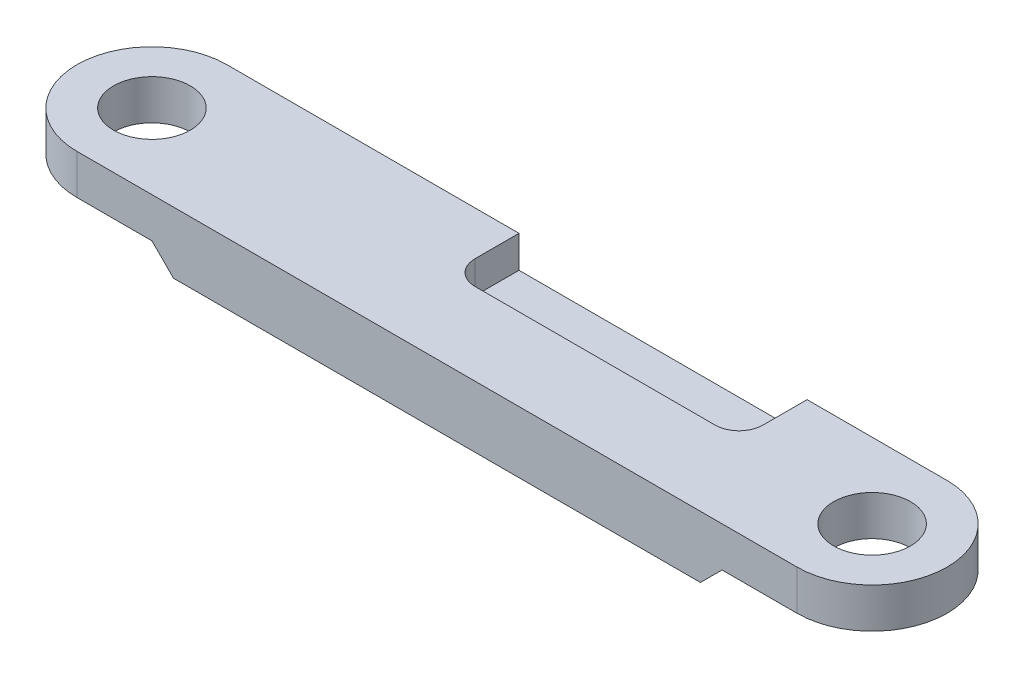
ISO-10303-21;
HEADER;
FILE_DESCRIPTION(('STEP AP214'),'2;1');
FILE_NAME('part.step','',(''),(''),'','','');
FILE_SCHEMA(('AUTOMOTIVE_DESIGN { 1 0 10303 214 1 1 1 1 }'));
ENDSEC;
DATA;
#1=APPLICATION_CONTEXT('core data for automotive mechanical design processes');
#2=APPLICATION_PROTOCOL_DEFINITION('international standard','automotive_design',2000,#1);
#3=PRODUCT_CONTEXT('',#1,'mechanical');
#4=PRODUCT('Part','Part','',(#3));
#5=PRODUCT_RELATED_PRODUCT_CATEGORY('part','',(#4));
#6=PRODUCT_DEFINITION_FORMATION('','',#4);
#7=PRODUCT_DEFINITION_CONTEXT('part definition',#1,'design');
#8=PRODUCT_DEFINITION('design','',#6,#7);
#9=PRODUCT_DEFINITION_SHAPE('','',#8);
#10=(LENGTH_UNIT() NAMED_UNIT(*) SI_UNIT(.MILLI.,.METRE.));
#11=(NAMED_UNIT(*) PLANE_ANGLE_UNIT() SI_UNIT($,.RADIAN.));
#12=(NAMED_UNIT(*) SI_UNIT($,.STERADIAN.) SOLID_ANGLE_UNIT());
#13=UNCERTAINTY_MEASURE_WITH_UNIT(LENGTH_MEASURE(1.E-05),#10,'distance_accuracy_value','');
#14=(GEOMETRIC_REPRESENTATION_CONTEXT(3) GLOBAL_UNCERTAINTY_ASSIGNED_CONTEXT((#13)) GLOBAL_UNIT_ASSIGNED_CONTEXT((#10,
#11,#12)) REPRESENTATION_CONTEXT('',''));
#15=CARTESIAN_POINT('',(0.,0.,0.));
#16=DIRECTION('',(0.,0.,1.));
#17=DIRECTION('',(1.,0.,0.));
#18=AXIS2_PLACEMENT_3D('',#15,#16,#17);
#19=CARTESIAN_POINT('',(-11.43,1.9558,0.));
#20=DIRECTION('',(0.,1.,0.));
#21=DIRECTION('',(0.,0.,1.));
#22=AXIS2_PLACEMENT_3D('',#19,#20,#21);
#23=PLANE('',#22);
#24=DIRECTION('',(0.,0.,-1.));
#25=VECTOR('',#24,1.);
#26=CARTESIAN_POINT('',(6.985,1.9558,-0.222250000000002));
#27=LINE('',#26,#25);
#28=CARTESIAN_POINT('',(6.985,1.9558,-0.984250000000003));
#29=VERTEX_POINT('',#28);
#30=CARTESIAN_POINT('',(6.985,1.9558,-2.38125));
#31=VERTEX_POINT('',#30);
#32=EDGE_CURVE('E239',#29,#31,#27,.T.);
#33=ORIENTED_EDGE('',*,*,#32,.F.);
#34=CARTESIAN_POINT('',(6.223,1.9558,-0.984250000000003));
#35=DIRECTION('',(0.,1.,0.));
#36=DIRECTION('',(0.,0.,1.));
#37=AXIS2_PLACEMENT_3D('',#34,#35,#36);
#38=CIRCLE('',#37,0.762);
#39=CARTESIAN_POINT('',(6.223,1.9558,-0.222250000000002));
#40=VERTEX_POINT('',#39);
#41=EDGE_CURVE('E11',#29,#40,#38,.F.);
#42=ORIENTED_EDGE('',*,*,#41,.T.);
#43=DIRECTION('',(1.,0.,0.));
#44=VECTOR('',#43,1.);
#45=CARTESIAN_POINT('',(6.985,1.9558,-0.222250000000002));
#46=LINE('',#45,#44);
#47=CARTESIAN_POINT('',(-1.397,1.9558,-0.222250000000001));
#48=VERTEX_POINT('',#47);
#49=EDGE_CURVE('E227',#48,#40,#46,.T.);
#50=ORIENTED_EDGE('',*,*,#49,.F.);
#51=CARTESIAN_POINT('',(-1.397,1.9558,-0.984250000000001));
#52=DIRECTION('',(0.,1.,0.));
#53=DIRECTION('',(0.,0.,1.));
#54=AXIS2_PLACEMENT_3D('',#51,#52,#53);
#55=CIRCLE('',#54,0.762);
#56=CARTESIAN_POINT('',(-2.159,1.9558,-0.984250000000001));
#57=VERTEX_POINT('',#56);
#58=EDGE_CURVE('E45',#48,#57,#55,.F.);
#59=ORIENTED_EDGE('',*,*,#58,.T.);
#60=DIRECTION('',(0.,0.,-1.));
#61=VECTOR('',#60,1.);
#62=CARTESIAN_POINT('',(-2.159,1.9558,-0.222250000000001));
#63=LINE('',#62,#61);
#64=CARTESIAN_POINT('',(-2.159,1.9558,-2.38125));
#65=VERTEX_POINT('',#64);
#66=EDGE_CURVE('E241',#57,#65,#63,.T.);
#67=ORIENTED_EDGE('',*,*,#66,.T.);
#68=DIRECTION('',(-1.,0.,0.));
#69=VECTOR('',#68,1.);
#70=CARTESIAN_POINT('',(-11.43,1.9558,-2.38125));
#71=LINE('',#70,#69);
#72=CARTESIAN_POINT('',(-11.43,1.9558,-2.38125));
#73=VERTEX_POINT('',#72);
#74=EDGE_CURVE('E252',#65,#73,#71,.T.);
#75=ORIENTED_EDGE('',*,*,#74,.T.);
#76=CARTESIAN_POINT('',(-11.43,1.9558,0.));
#77=DIRECTION('',(0.,1.,0.));
#78=DIRECTION('',(0.,0.,1.));
#79=AXIS2_PLACEMENT_3D('',#76,#77,#78);
#80=CIRCLE('',#79,2.38125);
#81=CARTESIAN_POINT('',(-11.43,1.9558,2.38125));
#82=VERTEX_POINT('',#81);
#83=EDGE_CURVE('E162',#73,#82,#80,.T.);
#84=ORIENTED_EDGE('',*,*,#83,.T.);
#85=DIRECTION('',(1.,0.,0.));
#86=VECTOR('',#85,1.);
#87=CARTESIAN_POINT('',(-11.43,1.9558,2.38125));
#88=LINE('',#87,#86);
#89=CARTESIAN_POINT('',(11.43,1.9558,2.38125));
#90=VERTEX_POINT('',#89);
#91=EDGE_CURVE('E250',#82,#90,#88,.T.);
#92=ORIENTED_EDGE('',*,*,#91,.T.);
#93=CARTESIAN_POINT('',(11.43,1.9558,0.));
#94=DIRECTION('',(0.,1.,0.));
#95=DIRECTION('',(0.,0.,-1.));
#96=AXIS2_PLACEMENT_3D('',#93,#94,#95);
#97=CIRCLE('',#96,2.38125);
#98=CARTESIAN_POINT('',(11.43,1.9558,-2.38125));
#99=VERTEX_POINT('',#98);
#100=EDGE_CURVE('E251',#90,#99,#97,.T.);
#101=ORIENTED_EDGE('',*,*,#100,.T.);
#102=EDGE_CURVE('E168',#99,#31,#71,.T.);
#103=ORIENTED_EDGE('',*,*,#102,.T.);
#104=EDGE_LOOP('',(#33,#42,#50,#59,#67,#75,#84,#92,#101,#103));
#105=FACE_BOUND('',#104,.T.);
#106=CARTESIAN_POINT('',(-11.43,1.9558,0.));
#107=DIRECTION('',(0.,1.,0.));
#108=DIRECTION('',(0.,0.,1.));
#109=AXIS2_PLACEMENT_3D('',#106,#107,#108);
#110=CIRCLE('',#109,1.2192);
#111=CARTESIAN_POINT('',(-11.43,1.9558,1.2192));
#112=VERTEX_POINT('',#111);
#113=EDGE_CURVE('E160',#112,#112,#110,.T.);
#114=ORIENTED_EDGE('',*,*,#113,.F.);
#115=EDGE_LOOP('',(#114));
#116=FACE_BOUND('',#115,.T.);
#117=CARTESIAN_POINT('',(11.43,1.9558,0.));
#118=DIRECTION('',(0.,1.,0.));
#119=DIRECTION('',(0.,0.,-1.));
#120=AXIS2_PLACEMENT_3D('',#117,#118,#119);
#121=CIRCLE('',#120,1.2192);
#122=CARTESIAN_POINT('',(11.43,1.9558,-1.2192));
#123=VERTEX_POINT('',#122);
#124=EDGE_CURVE('E165',#123,#123,#121,.T.);
#125=ORIENTED_EDGE('',*,*,#124,.F.);
#126=EDGE_LOOP('',(#125));
#127=FACE_BOUND('',#126,.T.);
#128=ADVANCED_FACE('F36',(#105,#116,#127),#23,.T.);
#129=CARTESIAN_POINT('',(-11.43,0.,0.));
#130=DIRECTION('',(0.,1.,0.));
#131=DIRECTION('',(0.,0.,1.));
#132=AXIS2_PLACEMENT_3D('',#129,#130,#131);
#133=PLANE('',#132);
#134=DIRECTION('',(-1.,0.,0.));
#135=VECTOR('',#134,1.);
#136=CARTESIAN_POINT('',(-11.43,0.,-2.38125));
#137=LINE('',#136,#135);
#138=CARTESIAN_POINT('',(8.36294999999999,0.,-2.38125));
#139=VERTEX_POINT('',#138);
#140=CARTESIAN_POINT('',(-8.36294999999999,0.,-2.38125));
#141=VERTEX_POINT('',#140);
#142=EDGE_CURVE('E154',#139,#141,#137,.T.);
#143=ORIENTED_EDGE('',*,*,#142,.F.);
#144=DIRECTION('',(0.,0.,-1.));
#145=VECTOR('',#144,1.);
#146=CARTESIAN_POINT('',(8.36294999999999,0.,2.38125));
#147=LINE('',#146,#145);
#148=CARTESIAN_POINT('',(8.36294999999999,0.,2.38125));
#149=VERTEX_POINT('',#148);
#150=EDGE_CURVE('E61',#149,#139,#147,.T.);
#151=ORIENTED_EDGE('',*,*,#150,.F.);
#152=DIRECTION('',(1.,0.,0.));
#153=VECTOR('',#152,1.);
#154=CARTESIAN_POINT('',(-11.43,0.,2.38125));
#155=LINE('',#154,#153);
#156=CARTESIAN_POINT('',(-8.36294999999999,0.,2.38125000000001));
#157=VERTEX_POINT('',#156);
#158=EDGE_CURVE('E152',#157,#149,#155,.T.);
#159=ORIENTED_EDGE('',*,*,#158,.F.);
#160=DIRECTION('',(0.,0.,-1.));
#161=VECTOR('',#160,1.);
#162=CARTESIAN_POINT('',(-8.36294999999999,0.,2.38125000000001));
#163=LINE('',#162,#161);
#164=EDGE_CURVE('E216',#157,#141,#163,.T.);
#165=ORIENTED_EDGE('',*,*,#164,.T.);
#166=EDGE_LOOP('',(#143,#151,#159,#165));
#167=FACE_BOUND('',#166,.T.);
#168=ADVANCED_FACE('F150',(#167),#133,.F.);
#169=CARTESIAN_POINT('',(-11.43,1.9558,0.));
#170=DIRECTION('',(0.,-1.,0.));
#171=DIRECTION('',(0.,0.,-1.));
#172=AXIS2_PLACEMENT_3D('',#169,#170,#171);
#173=CYLINDRICAL_SURFACE('',#172,2.38125);
#174=DIRECTION('',(0.,-1.,0.));
#175=VECTOR('',#174,1.);
#176=CARTESIAN_POINT('',(-11.43,1.9558,-2.38125));
#177=LINE('',#176,#175);
#178=CARTESIAN_POINT('',(-11.43,0.685800000000001,-2.38125));
#179=VERTEX_POINT('',#178);
#180=EDGE_CURVE('E171',#73,#179,#177,.T.);
#181=ORIENTED_EDGE('',*,*,#180,.T.);
#182=CARTESIAN_POINT('',(-11.43,0.685800000000001,0.));
#183=DIRECTION('',(0.,1.,0.));
#184=DIRECTION('',(-1.,0.,0.));
#185=AXIS2_PLACEMENT_3D('',#182,#183,#184);
#186=CIRCLE('',#185,2.38125);
#187=CARTESIAN_POINT('',(-11.43,0.685800000000001,2.38125000000001));
#188=VERTEX_POINT('',#187);
#189=EDGE_CURVE('E220',#179,#188,#186,.T.);
#190=ORIENTED_EDGE('',*,*,#189,.T.);
#191=DIRECTION('',(0.,-1.,0.));
#192=VECTOR('',#191,1.);
#193=CARTESIAN_POINT('',(-11.43,1.9558,2.38125));
#194=LINE('',#193,#192);
#195=EDGE_CURVE('E180',#82,#188,#194,.T.);
#196=ORIENTED_EDGE('',*,*,#195,.F.);
#197=ORIENTED_EDGE('',*,*,#83,.F.);
#198=EDGE_LOOP('',(#181,#190,#196,#197));
#199=FACE_BOUND('',#198,.T.);
#200=ADVANCED_FACE('F293',(#199),#173,.T.);
#201=CARTESIAN_POINT('',(-11.43,1.9558,2.38125));
#202=DIRECTION('',(0.,0.,-1.));
#203=DIRECTION('',(-1.,0.,0.));
#204=AXIS2_PLACEMENT_3D('',#201,#202,#203);
#205=PLANE('',#204);
#206=DIRECTION('',(0.707106781186552,0.707106781186544,0.));
#207=VECTOR('',#206,1.);
#208=CARTESIAN_POINT('',(8.36294999999999,0.,2.38125));
#209=LINE('',#208,#207);
#210=CARTESIAN_POINT('',(9.04875,0.6858,2.38125));
#211=VERTEX_POINT('',#210);
#212=EDGE_CURVE('E137',#149,#211,#209,.T.);
#213=ORIENTED_EDGE('',*,*,#212,.T.);
#214=DIRECTION('',(1.,0.,0.));
#215=VECTOR('',#214,1.);
#216=CARTESIAN_POINT('',(9.04875,0.6858,2.38125));
#217=LINE('',#216,#215);
#218=CARTESIAN_POINT('',(11.43,0.6858,2.38125));
#219=VERTEX_POINT('',#218);
#220=EDGE_CURVE('E144',#211,#219,#217,.T.);
#221=ORIENTED_EDGE('',*,*,#220,.T.);
#222=DIRECTION('',(0.,-1.,0.));
#223=VECTOR('',#222,1.);
#224=CARTESIAN_POINT('',(11.43,1.9558,2.38125));
#225=LINE('',#224,#223);
#226=EDGE_CURVE('E177',#90,#219,#225,.T.);
#227=ORIENTED_EDGE('',*,*,#226,.F.);
#228=ORIENTED_EDGE('',*,*,#91,.F.);
#229=ORIENTED_EDGE('',*,*,#195,.T.);
#230=DIRECTION('',(1.,0.,0.));
#231=VECTOR('',#230,1.);
#232=CARTESIAN_POINT('',(-9.04875,0.685800000000002,2.38125000000001));
#233=LINE('',#232,#231);
#234=CARTESIAN_POINT('',(-9.04875,0.685800000000002,2.38125000000001));
#235=VERTEX_POINT('',#234);
#236=EDGE_CURVE('E209',#188,#235,#233,.T.);
#237=ORIENTED_EDGE('',*,*,#236,.T.);
#238=DIRECTION('',(0.707106781186551,-0.707106781186544,0.));
#239=VECTOR('',#238,1.);
#240=CARTESIAN_POINT('',(-8.36294999999999,0.,2.38125000000001));
#241=LINE('',#240,#239);
#242=EDGE_CURVE('E159',#235,#157,#241,.T.);
#243=ORIENTED_EDGE('',*,*,#242,.T.);
#244=ORIENTED_EDGE('',*,*,#158,.T.);
#245=EDGE_LOOP('',(#213,#221,#227,#228,#229,#237,#243,#244));
#246=FACE_BOUND('',#245,.T.);
#247=ADVANCED_FACE('F157',(#246),#205,.F.);
#248=CARTESIAN_POINT('',(11.43,1.9558,0.));
#249=DIRECTION('',(0.,-1.,0.));
#250=DIRECTION('',(0.,0.,-1.));
#251=AXIS2_PLACEMENT_3D('',#248,#249,#250);
#252=CYLINDRICAL_SURFACE('',#251,2.38125);
#253=ORIENTED_EDGE('',*,*,#226,.T.);
#254=CARTESIAN_POINT('',(11.43,0.6858,0.));
#255=DIRECTION('',(0.,1.,0.));
#256=DIRECTION('',(-1.,0.,0.));
#257=AXIS2_PLACEMENT_3D('',#254,#255,#256);
#258=CIRCLE('',#257,2.38125);
#259=CARTESIAN_POINT('',(11.43,0.6858,-2.38125));
#260=VERTEX_POINT('',#259);
#261=EDGE_CURVE('E199',#219,#260,#258,.T.);
#262=ORIENTED_EDGE('',*,*,#261,.T.);
#263=DIRECTION('',(0.,-1.,0.));
#264=VECTOR('',#263,1.);
#265=CARTESIAN_POINT('',(11.43,1.9558,-2.38125));
#266=LINE('',#265,#264);
#267=EDGE_CURVE('E174',#99,#260,#266,.T.);
#268=ORIENTED_EDGE('',*,*,#267,.F.);
#269=ORIENTED_EDGE('',*,*,#100,.F.);
#270=EDGE_LOOP('',(#253,#262,#268,#269));
#271=FACE_BOUND('',#270,.T.);
#272=ADVANCED_FACE('F296',(#271),#252,.T.);
#273=CARTESIAN_POINT('',(-11.43,1.9558,-2.38125));
#274=DIRECTION('',(0.,0.,1.));
#275=DIRECTION('',(1.,0.,0.));
#276=AXIS2_PLACEMENT_3D('',#273,#274,#275);
#277=PLANE('',#276);
#278=ORIENTED_EDGE('',*,*,#267,.T.);
#279=DIRECTION('',(1.,0.,0.));
#280=VECTOR('',#279,1.);
#281=CARTESIAN_POINT('',(9.04875,0.6858,-2.38125));
#282=LINE('',#281,#280);
#283=CARTESIAN_POINT('',(9.04875,0.6858,-2.38125));
#284=VERTEX_POINT('',#283);
#285=EDGE_CURVE('E145',#284,#260,#282,.T.);
#286=ORIENTED_EDGE('',*,*,#285,.F.);
#287=DIRECTION('',(0.707106781186552,0.707106781186544,0.));
#288=VECTOR('',#287,1.);
#289=CARTESIAN_POINT('',(8.36294999999999,0.,-2.38125));
#290=LINE('',#289,#288);
#291=EDGE_CURVE('E218',#139,#284,#290,.T.);
#292=ORIENTED_EDGE('',*,*,#291,.F.);
#293=ORIENTED_EDGE('',*,*,#142,.T.);
#294=DIRECTION('',(0.707106781186551,-0.707106781186544,0.));
#295=VECTOR('',#294,1.);
#296=CARTESIAN_POINT('',(-8.36294999999999,0.,-2.38125));
#297=LINE('',#296,#295);
#298=CARTESIAN_POINT('',(-9.04875,0.6858,-2.38125));
#299=VERTEX_POINT('',#298);
#300=EDGE_CURVE('E211',#299,#141,#297,.T.);
#301=ORIENTED_EDGE('',*,*,#300,.F.);
#302=DIRECTION('',(1.,0.,0.));
#303=VECTOR('',#302,1.);
#304=CARTESIAN_POINT('',(-9.04875,0.685800000000002,-2.38125));
#305=LINE('',#304,#303);
#306=EDGE_CURVE('E213',#179,#299,#305,.T.);
#307=ORIENTED_EDGE('',*,*,#306,.F.);
#308=ORIENTED_EDGE('',*,*,#180,.F.);
#309=ORIENTED_EDGE('',*,*,#74,.F.);
#310=DIRECTION('',(0.,1.,0.));
#311=VECTOR('',#310,1.);
#312=CARTESIAN_POINT('',(-2.159,1.9558,-2.38125));
#313=LINE('',#312,#311);
#314=CARTESIAN_POINT('',(-2.159,0.9398,-2.38125));
#315=VERTEX_POINT('',#314);
#316=EDGE_CURVE('E228',#315,#65,#313,.T.);
#317=ORIENTED_EDGE('',*,*,#316,.F.);
#318=DIRECTION('',(-1.,0.,0.));
#319=VECTOR('',#318,1.);
#320=CARTESIAN_POINT('',(6.985,0.9398,-2.38125));
#321=LINE('',#320,#319);
#322=CARTESIAN_POINT('',(6.985,0.9398,-2.38125));
#323=VERTEX_POINT('',#322);
#324=EDGE_CURVE('E234',#323,#315,#321,.T.);
#325=ORIENTED_EDGE('',*,*,#324,.F.);
#326=DIRECTION('',(0.,-1.,0.));
#327=VECTOR('',#326,1.);
#328=CARTESIAN_POINT('',(6.985,1.9558,-2.38125));
#329=LINE('',#328,#327);
#330=EDGE_CURVE('E223',#31,#323,#329,.T.);
#331=ORIENTED_EDGE('',*,*,#330,.F.);
#332=ORIENTED_EDGE('',*,*,#102,.F.);
#333=EDGE_LOOP('',(#278,#286,#292,#293,#301,#307,#308,#309,#317,#325,#331,#332));
#334=FACE_BOUND('',#333,.T.);
#335=ADVANCED_FACE('F265',(#334),#277,.F.);
#336=CARTESIAN_POINT('',(-11.43,1.9558,0.));
#337=DIRECTION('',(0.,-1.,0.));
#338=DIRECTION('',(0.,0.,-1.));
#339=AXIS2_PLACEMENT_3D('',#336,#337,#338);
#340=CYLINDRICAL_SURFACE('',#339,1.2192);
#341=CARTESIAN_POINT('',(-11.43,0.685800000000001,0.));
#342=DIRECTION('',(0.,1.,0.));
#343=DIRECTION('',(-1.,0.,0.));
#344=AXIS2_PLACEMENT_3D('',#341,#342,#343);
#345=CIRCLE('',#344,1.2192);
#346=CARTESIAN_POINT('',(-12.6492,0.6858,0.));
#347=VERTEX_POINT('',#346);
#348=EDGE_CURVE('E40',#347,#347,#345,.T.);
#349=ORIENTED_EDGE('',*,*,#348,.F.);
#350=EDGE_LOOP('',(#349));
#351=FACE_BOUND('',#350,.T.);
#352=ORIENTED_EDGE('',*,*,#113,.T.);
#353=EDGE_LOOP('',(#352));
#354=FACE_BOUND('',#353,.T.);
#355=ADVANCED_FACE('F320',(#351,#354),#340,.F.);
#356=CARTESIAN_POINT('',(11.43,1.9558,0.));
#357=DIRECTION('',(0.,-1.,0.));
#358=DIRECTION('',(0.,0.,-1.));
#359=AXIS2_PLACEMENT_3D('',#356,#357,#358);
#360=CYLINDRICAL_SURFACE('',#359,1.2192);
#361=CARTESIAN_POINT('',(11.43,0.6858,0.));
#362=DIRECTION('',(0.,1.,0.));
#363=DIRECTION('',(-1.,0.,0.));
#364=AXIS2_PLACEMENT_3D('',#361,#362,#363);
#365=CIRCLE('',#364,1.2192);
#366=CARTESIAN_POINT('',(10.2108,0.6858,0.));
#367=VERTEX_POINT('',#366);
#368=EDGE_CURVE('E197',#367,#367,#365,.T.);
#369=ORIENTED_EDGE('',*,*,#368,.F.);
#370=EDGE_LOOP('',(#369));
#371=FACE_BOUND('',#370,.T.);
#372=ORIENTED_EDGE('',*,*,#124,.T.);
#373=EDGE_LOOP('',(#372));
#374=FACE_BOUND('',#373,.T.);
#375=ADVANCED_FACE('F345',(#371,#374),#360,.F.);
#376=CARTESIAN_POINT('',(6.985,1.9558,-0.222250000000002));
#377=DIRECTION('',(1.,0.,0.));
#378=DIRECTION('',(0.,0.,-1.));
#379=AXIS2_PLACEMENT_3D('',#376,#377,#378);
#380=PLANE('',#379);
#381=DIRECTION('',(0.,0.,-1.));
#382=VECTOR('',#381,1.);
#383=CARTESIAN_POINT('',(6.985,0.9398,-0.222250000000002));
#384=LINE('',#383,#382);
#385=CARTESIAN_POINT('',(6.985,0.9398,-0.984250000000003));
#386=VERTEX_POINT('',#385);
#387=EDGE_CURVE('E231',#386,#323,#384,.T.);
#388=ORIENTED_EDGE('',*,*,#387,.F.);
#389=DIRECTION('',(0.,-1.,0.));
#390=VECTOR('',#389,1.);
#391=CARTESIAN_POINT('',(6.985,1.9558,-0.984250000000003));
#392=LINE('',#391,#390);
#393=EDGE_CURVE('E195',#386,#29,#392,.F.);
#394=ORIENTED_EDGE('',*,*,#393,.T.);
#395=ORIENTED_EDGE('',*,*,#32,.T.);
#396=ORIENTED_EDGE('',*,*,#330,.T.);
#397=EDGE_LOOP('',(#388,#394,#395,#396));
#398=FACE_BOUND('',#397,.T.);
#399=ADVANCED_FACE('F271',(#398),#380,.F.);
#400=CARTESIAN_POINT('',(-2.159,1.9558,-0.222250000000001));
#401=DIRECTION('',(-1.,0.,0.));
#402=DIRECTION('',(0.,0.,1.));
#403=AXIS2_PLACEMENT_3D('',#400,#401,#402);
#404=PLANE('',#403);
#405=ORIENTED_EDGE('',*,*,#66,.F.);
#406=DIRECTION('',(0.,1.,0.));
#407=VECTOR('',#406,1.);
#408=CARTESIAN_POINT('',(-2.159,1.9558,-0.984250000000001));
#409=LINE('',#408,#407);
#410=CARTESIAN_POINT('',(-2.159,0.9398,-0.984250000000001));
#411=VERTEX_POINT('',#410);
#412=EDGE_CURVE('E189',#57,#411,#409,.F.);
#413=ORIENTED_EDGE('',*,*,#412,.T.);
#414=DIRECTION('',(0.,0.,-1.));
#415=VECTOR('',#414,1.);
#416=CARTESIAN_POINT('',(-2.159,0.9398,-0.222250000000001));
#417=LINE('',#416,#415);
#418=EDGE_CURVE('E243',#411,#315,#417,.T.);
#419=ORIENTED_EDGE('',*,*,#418,.T.);
#420=ORIENTED_EDGE('',*,*,#316,.T.);
#421=EDGE_LOOP('',(#405,#413,#419,#420));
#422=FACE_BOUND('',#421,.T.);
#423=ADVANCED_FACE('F286',(#422),#404,.F.);
#424=CARTESIAN_POINT('',(6.985,0.9398,-0.222250000000002));
#425=DIRECTION('',(0.,-1.,0.));
#426=DIRECTION('',(0.,0.,-1.));
#427=AXIS2_PLACEMENT_3D('',#424,#425,#426);
#428=PLANE('',#427);
#429=ORIENTED_EDGE('',*,*,#418,.F.);
#430=CARTESIAN_POINT('',(-1.397,0.9398,-0.984250000000001));
#431=DIRECTION('',(0.,-1.,0.));
#432=DIRECTION('',(0.,0.,-1.));
#433=AXIS2_PLACEMENT_3D('',#430,#431,#432);
#434=CIRCLE('',#433,0.762);
#435=CARTESIAN_POINT('',(-1.397,0.9398,-0.222250000000001));
#436=VERTEX_POINT('',#435);
#437=EDGE_CURVE('E193',#411,#436,#434,.F.);
#438=ORIENTED_EDGE('',*,*,#437,.T.);
#439=DIRECTION('',(-1.,0.,0.));
#440=VECTOR('',#439,1.);
#441=CARTESIAN_POINT('',(6.985,0.9398,-0.222250000000002));
#442=LINE('',#441,#440);
#443=CARTESIAN_POINT('',(6.223,0.9398,-0.222250000000002));
#444=VERTEX_POINT('',#443);
#445=EDGE_CURVE('E224',#444,#436,#442,.T.);
#446=ORIENTED_EDGE('',*,*,#445,.F.);
#447=CARTESIAN_POINT('',(6.223,0.9398,-0.984250000000003));
#448=DIRECTION('',(0.,-1.,0.));
#449=DIRECTION('',(0.,0.,-1.));
#450=AXIS2_PLACEMENT_3D('',#447,#448,#449);
#451=CIRCLE('',#450,0.762);
#452=EDGE_CURVE('E191',#444,#386,#451,.F.);
#453=ORIENTED_EDGE('',*,*,#452,.T.);
#454=ORIENTED_EDGE('',*,*,#387,.T.);
#455=ORIENTED_EDGE('',*,*,#324,.T.);
#456=EDGE_LOOP('',(#429,#438,#446,#453,#454,#455));
#457=FACE_BOUND('',#456,.T.);
#458=ADVANCED_FACE('F335',(#457),#428,.F.);
#459=CARTESIAN_POINT('',(0.,0.,-0.222250000000002));
#460=DIRECTION('',(0.,0.,-1.));
#461=DIRECTION('',(-1.,0.,0.));
#462=AXIS2_PLACEMENT_3D('',#459,#460,#461);
#463=PLANE('',#462);
#464=ORIENTED_EDGE('',*,*,#445,.T.);
#465=DIRECTION('',(0.,1.,0.));
#466=VECTOR('',#465,1.);
#467=CARTESIAN_POINT('',(-1.397,0.,-0.222250000000001));
#468=LINE('',#467,#466);
#469=EDGE_CURVE('E186',#436,#48,#468,.T.);
#470=ORIENTED_EDGE('',*,*,#469,.T.);
#471=ORIENTED_EDGE('',*,*,#49,.T.);
#472=DIRECTION('',(0.,-1.,0.));
#473=VECTOR('',#472,1.);
#474=CARTESIAN_POINT('',(6.223,0.,-0.222250000000002));
#475=LINE('',#474,#473);
#476=EDGE_CURVE('E183',#40,#444,#475,.T.);
#477=ORIENTED_EDGE('',*,*,#476,.T.);
#478=EDGE_LOOP('',(#464,#470,#471,#477));
#479=FACE_BOUND('',#478,.T.);
#480=ADVANCED_FACE('F277',(#479),#463,.T.);
#481=CARTESIAN_POINT('',(-1.397,0.,-0.984250000000001));
#482=DIRECTION('',(0.,1.,0.));
#483=DIRECTION('',(0.,0.,1.));
#484=AXIS2_PLACEMENT_3D('',#481,#482,#483);
#485=CYLINDRICAL_SURFACE('',#484,0.762);
#486=ORIENTED_EDGE('',*,*,#437,.F.);
#487=ORIENTED_EDGE('',*,*,#412,.F.);
#488=ORIENTED_EDGE('',*,*,#58,.F.);
#489=ORIENTED_EDGE('',*,*,#469,.F.);
#490=EDGE_LOOP('',(#486,#487,#488,#489));
#491=FACE_BOUND('',#490,.T.);
#492=ADVANCED_FACE('F282',(#491),#485,.F.);
#493=CARTESIAN_POINT('',(6.223,0.,-0.984250000000003));
#494=DIRECTION('',(0.,-1.,0.));
#495=DIRECTION('',(0.,0.,-1.));
#496=AXIS2_PLACEMENT_3D('',#493,#494,#495);
#497=CYLINDRICAL_SURFACE('',#496,0.762);
#498=ORIENTED_EDGE('',*,*,#41,.F.);
#499=ORIENTED_EDGE('',*,*,#393,.F.);
#500=ORIENTED_EDGE('',*,*,#452,.F.);
#501=ORIENTED_EDGE('',*,*,#476,.F.);
#502=EDGE_LOOP('',(#498,#499,#500,#501));
#503=FACE_BOUND('',#502,.T.);
#504=ADVANCED_FACE('F38',(#503),#497,.F.);
#505=CARTESIAN_POINT('',(9.04875,0.6858,2.38125));
#506=DIRECTION('',(0.,1.,0.));
#507=DIRECTION('',(-1.,0.,0.));
#508=AXIS2_PLACEMENT_3D('',#505,#506,#507);
#509=PLANE('',#508);
#510=ORIENTED_EDGE('',*,*,#368,.T.);
#511=EDGE_LOOP('',(#510));
#512=FACE_BOUND('',#511,.T.);
#513=ORIENTED_EDGE('',*,*,#220,.F.);
#514=DIRECTION('',(0.,0.,-1.));
#515=VECTOR('',#514,1.);
#516=CARTESIAN_POINT('',(9.04875,0.6858,2.38125));
#517=LINE('',#516,#515);
#518=EDGE_CURVE('E139',#211,#284,#517,.T.);
#519=ORIENTED_EDGE('',*,*,#518,.T.);
#520=ORIENTED_EDGE('',*,*,#285,.T.);
#521=ORIENTED_EDGE('',*,*,#261,.F.);
#522=EDGE_LOOP('',(#513,#519,#520,#521));
#523=FACE_BOUND('',#522,.T.);
#524=ADVANCED_FACE('F297',(#512,#523),#509,.F.);
#525=CARTESIAN_POINT('',(8.36294999999999,0.,2.38125));
#526=DIRECTION('',(-0.707106781186544,0.707106781186551,0.));
#527=DIRECTION('',(-0.707106781186551,-0.707106781186544,0.));
#528=AXIS2_PLACEMENT_3D('',#525,#526,#527);
#529=PLANE('',#528);
#530=ORIENTED_EDGE('',*,*,#291,.T.);
#531=ORIENTED_EDGE('',*,*,#518,.F.);
#532=ORIENTED_EDGE('',*,*,#212,.F.);
#533=ORIENTED_EDGE('',*,*,#150,.T.);
#534=EDGE_LOOP('',(#530,#531,#532,#533));
#535=FACE_BOUND('',#534,.T.);
#536=ADVANCED_FACE('F138',(#535),#529,.F.);
#537=CARTESIAN_POINT('',(-9.04875,0.685800000000002,2.38125000000001));
#538=DIRECTION('',(0.,1.,0.));
#539=DIRECTION('',(-1.,0.,0.));
#540=AXIS2_PLACEMENT_3D('',#537,#538,#539);
#541=PLANE('',#540);
#542=ORIENTED_EDGE('',*,*,#348,.T.);
#543=EDGE_LOOP('',(#542));
#544=FACE_BOUND('',#543,.T.);
#545=ORIENTED_EDGE('',*,*,#306,.T.);
#546=DIRECTION('',(0.,0.,-1.));
#547=VECTOR('',#546,1.);
#548=CARTESIAN_POINT('',(-9.04875,0.685800000000002,2.38125000000001));
#549=LINE('',#548,#547);
#550=EDGE_CURVE('E53',#235,#299,#549,.T.);
#551=ORIENTED_EDGE('',*,*,#550,.F.);
#552=ORIENTED_EDGE('',*,*,#236,.F.);
#553=ORIENTED_EDGE('',*,*,#189,.F.);
#554=EDGE_LOOP('',(#545,#551,#552,#553));
#555=FACE_BOUND('',#554,.T.);
#556=ADVANCED_FACE('F301',(#544,#555),#541,.F.);
#557=CARTESIAN_POINT('',(-8.36294999999999,0.,2.38125000000001));
#558=DIRECTION('',(0.707106781186544,0.707106781186551,0.));
#559=DIRECTION('',(-0.707106781186551,0.707106781186544,0.));
#560=AXIS2_PLACEMENT_3D('',#557,#558,#559);
#561=PLANE('',#560);
#562=ORIENTED_EDGE('',*,*,#300,.T.);
#563=ORIENTED_EDGE('',*,*,#164,.F.);
#564=ORIENTED_EDGE('',*,*,#242,.F.);
#565=ORIENTED_EDGE('',*,*,#550,.T.);
#566=EDGE_LOOP('',(#562,#563,#564,#565));
#567=FACE_BOUND('',#566,.T.);
#568=ADVANCED_FACE('F299',(#567),#561,.F.);
#569=CLOSED_SHELL('',(#128,#168,#200,#247,#272,#335,#355,#375,#399,#423,#458,#480,#492,#504,
#524,#536,#556,#568));
#570=MANIFOLD_SOLID_BREP('B2',#569);
#571=ADVANCED_BREP_SHAPE_REPRESENTATION('',(#18,#570),#14);
#572=SHAPE_DEFINITION_REPRESENTATION(#9,#571);
ENDSEC;
END-ISO-10303-21;
